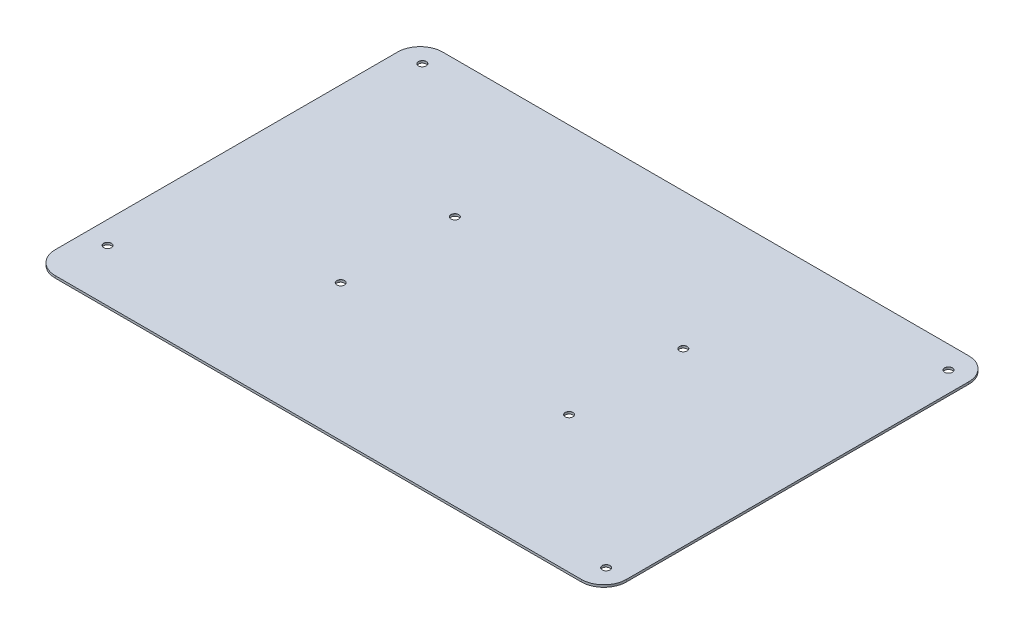
ISO-10303-21;
HEADER;
FILE_DESCRIPTION(('STEP AP214'),'2;1');
FILE_NAME('part.step','',(''),(''),'','','');
FILE_SCHEMA(('AUTOMOTIVE_DESIGN { 1 0 10303 214 1 1 1 1 }'));
ENDSEC;
DATA;
#1=APPLICATION_CONTEXT('core data for automotive mechanical design processes');
#2=APPLICATION_PROTOCOL_DEFINITION('international standard','automotive_design',2000,#1);
#3=PRODUCT_CONTEXT('',#1,'mechanical');
#4=PRODUCT('Part','Part','',(#3));
#5=PRODUCT_RELATED_PRODUCT_CATEGORY('part','',(#4));
#6=PRODUCT_DEFINITION_FORMATION('','',#4);
#7=PRODUCT_DEFINITION_CONTEXT('part definition',#1,'design');
#8=PRODUCT_DEFINITION('design','',#6,#7);
#9=PRODUCT_DEFINITION_SHAPE('','',#8);
#10=(LENGTH_UNIT() NAMED_UNIT(*) SI_UNIT(.MILLI.,.METRE.));
#11=(NAMED_UNIT(*) PLANE_ANGLE_UNIT() SI_UNIT($,.RADIAN.));
#12=(NAMED_UNIT(*) SI_UNIT($,.STERADIAN.) SOLID_ANGLE_UNIT());
#13=UNCERTAINTY_MEASURE_WITH_UNIT(LENGTH_MEASURE(1.E-05),#10,'distance_accuracy_value','');
#14=(GEOMETRIC_REPRESENTATION_CONTEXT(3) GLOBAL_UNCERTAINTY_ASSIGNED_CONTEXT((#13)) GLOBAL_UNIT_ASSIGNED_CONTEXT((#10,
#11,#12)) REPRESENTATION_CONTEXT('',''));
#15=CARTESIAN_POINT('',(0.,0.,0.));
#16=DIRECTION('',(0.,0.,1.));
#17=DIRECTION('',(1.,0.,0.));
#18=AXIS2_PLACEMENT_3D('',#15,#16,#17);
#19=CARTESIAN_POINT('',(127.,1.,-86.135));
#20=DIRECTION('',(-1.,0.,0.));
#21=DIRECTION('',(0.,0.,1.));
#22=AXIS2_PLACEMENT_3D('',#19,#20,#21);
#23=PLANE('',#22);
#24=DIRECTION('',(0.,0.,-1.));
#25=VECTOR('',#24,1.);
#26=CARTESIAN_POINT('',(127.,1.,-86.135));
#27=LINE('',#26,#25);
#28=CARTESIAN_POINT('',(127.,1.,76.135));
#29=VERTEX_POINT('',#28);
#30=CARTESIAN_POINT('',(127.,1.,-76.135));
#31=VERTEX_POINT('',#30);
#32=EDGE_CURVE('E140',#29,#31,#27,.T.);
#33=ORIENTED_EDGE('',*,*,#32,.F.);
#34=DIRECTION('',(0.,-1.,0.));
#35=VECTOR('',#34,1.);
#36=CARTESIAN_POINT('',(127.,1.,76.135));
#37=LINE('',#36,#35);
#38=CARTESIAN_POINT('',(127.,0.,76.135));
#39=VERTEX_POINT('',#38);
#40=EDGE_CURVE('E179',#29,#39,#37,.T.);
#41=ORIENTED_EDGE('',*,*,#40,.T.);
#42=DIRECTION('',(0.,0.,-1.));
#43=VECTOR('',#42,1.);
#44=CARTESIAN_POINT('',(127.,0.,-86.135));
#45=LINE('',#44,#43);
#46=CARTESIAN_POINT('',(127.,0.,-76.135));
#47=VERTEX_POINT('',#46);
#48=EDGE_CURVE('E194',#39,#47,#45,.T.);
#49=ORIENTED_EDGE('',*,*,#48,.T.);
#50=DIRECTION('',(0.,-1.,0.));
#51=VECTOR('',#50,1.);
#52=CARTESIAN_POINT('',(127.,1.,-76.135));
#53=LINE('',#52,#51);
#54=EDGE_CURVE('E176',#47,#31,#53,.F.);
#55=ORIENTED_EDGE('',*,*,#54,.T.);
#56=EDGE_LOOP('',(#33,#41,#49,#55));
#57=FACE_BOUND('',#56,.T.);
#58=ADVANCED_FACE('F44',(#57),#23,.F.);
#59=CARTESIAN_POINT('',(-127.,1.,-86.135));
#60=DIRECTION('',(0.,0.,1.));
#61=DIRECTION('',(1.,0.,0.));
#62=AXIS2_PLACEMENT_3D('',#59,#60,#61);
#63=PLANE('',#62);
#64=DIRECTION('',(-1.,0.,0.));
#65=VECTOR('',#64,1.);
#66=CARTESIAN_POINT('',(-127.,1.,-86.135));
#67=LINE('',#66,#65);
#68=CARTESIAN_POINT('',(117.,1.,-86.135));
#69=VERTEX_POINT('',#68);
#70=CARTESIAN_POINT('',(-117.,1.,-86.135));
#71=VERTEX_POINT('',#70);
#72=EDGE_CURVE('E145',#69,#71,#67,.T.);
#73=ORIENTED_EDGE('',*,*,#72,.F.);
#74=DIRECTION('',(0.,-1.,0.));
#75=VECTOR('',#74,1.);
#76=CARTESIAN_POINT('',(117.,1.,-86.135));
#77=LINE('',#76,#75);
#78=CARTESIAN_POINT('',(117.,0.,-86.135));
#79=VERTEX_POINT('',#78);
#80=EDGE_CURVE('E11',#69,#79,#77,.T.);
#81=ORIENTED_EDGE('',*,*,#80,.T.);
#82=DIRECTION('',(-1.,0.,0.));
#83=VECTOR('',#82,1.);
#84=CARTESIAN_POINT('',(-127.,0.,-86.135));
#85=LINE('',#84,#83);
#86=CARTESIAN_POINT('',(-117.,0.,-86.135));
#87=VERTEX_POINT('',#86);
#88=EDGE_CURVE('E147',#79,#87,#85,.T.);
#89=ORIENTED_EDGE('',*,*,#88,.T.);
#90=DIRECTION('',(0.,-1.,0.));
#91=VECTOR('',#90,1.);
#92=CARTESIAN_POINT('',(-117.,1.,-86.135));
#93=LINE('',#92,#91);
#94=EDGE_CURVE('E53',#87,#71,#93,.F.);
#95=ORIENTED_EDGE('',*,*,#94,.T.);
#96=EDGE_LOOP('',(#73,#81,#89,#95));
#97=FACE_BOUND('',#96,.T.);
#98=ADVANCED_FACE('F200',(#97),#63,.F.);
#99=CARTESIAN_POINT('',(-127.,1.,-86.135));
#100=DIRECTION('',(1.,0.,0.));
#101=DIRECTION('',(0.,0.,-1.));
#102=AXIS2_PLACEMENT_3D('',#99,#100,#101);
#103=PLANE('',#102);
#104=DIRECTION('',(0.,0.,1.));
#105=VECTOR('',#104,1.);
#106=CARTESIAN_POINT('',(-127.,0.,-86.135));
#107=LINE('',#106,#105);
#108=CARTESIAN_POINT('',(-127.,0.,-76.135));
#109=VERTEX_POINT('',#108);
#110=CARTESIAN_POINT('',(-127.,0.,76.135));
#111=VERTEX_POINT('',#110);
#112=EDGE_CURVE('E141',#109,#111,#107,.T.);
#113=ORIENTED_EDGE('',*,*,#112,.T.);
#114=DIRECTION('',(0.,-1.,0.));
#115=VECTOR('',#114,1.);
#116=CARTESIAN_POINT('',(-127.,1.,76.135));
#117=LINE('',#116,#115);
#118=CARTESIAN_POINT('',(-127.,1.,76.135));
#119=VERTEX_POINT('',#118);
#120=EDGE_CURVE('E116',#111,#119,#117,.F.);
#121=ORIENTED_EDGE('',*,*,#120,.T.);
#122=DIRECTION('',(0.,0.,1.));
#123=VECTOR('',#122,1.);
#124=CARTESIAN_POINT('',(-127.,1.,-86.135));
#125=LINE('',#124,#123);
#126=CARTESIAN_POINT('',(-127.,1.,-76.135));
#127=VERTEX_POINT('',#126);
#128=EDGE_CURVE('E185',#127,#119,#125,.T.);
#129=ORIENTED_EDGE('',*,*,#128,.F.);
#130=DIRECTION('',(0.,-1.,0.));
#131=VECTOR('',#130,1.);
#132=CARTESIAN_POINT('',(-127.,1.,-76.135));
#133=LINE('',#132,#131);
#134=EDGE_CURVE('E122',#127,#109,#133,.T.);
#135=ORIENTED_EDGE('',*,*,#134,.T.);
#136=EDGE_LOOP('',(#113,#121,#129,#135));
#137=FACE_BOUND('',#136,.T.);
#138=ADVANCED_FACE('F207',(#137),#103,.F.);
#139=CARTESIAN_POINT('',(-127.,1.,86.135));
#140=DIRECTION('',(0.,0.,-1.));
#141=DIRECTION('',(-1.,0.,0.));
#142=AXIS2_PLACEMENT_3D('',#139,#140,#141);
#143=PLANE('',#142);
#144=DIRECTION('',(1.,0.,0.));
#145=VECTOR('',#144,1.);
#146=CARTESIAN_POINT('',(-127.,1.,86.135));
#147=LINE('',#146,#145);
#148=CARTESIAN_POINT('',(-117.,1.,86.135));
#149=VERTEX_POINT('',#148);
#150=CARTESIAN_POINT('',(117.,1.,86.135));
#151=VERTEX_POINT('',#150);
#152=EDGE_CURVE('E132',#149,#151,#147,.T.);
#153=ORIENTED_EDGE('',*,*,#152,.F.);
#154=DIRECTION('',(0.,-1.,0.));
#155=VECTOR('',#154,1.);
#156=CARTESIAN_POINT('',(-117.,1.,86.135));
#157=LINE('',#156,#155);
#158=CARTESIAN_POINT('',(-117.,0.,86.135));
#159=VERTEX_POINT('',#158);
#160=EDGE_CURVE('E115',#149,#159,#157,.T.);
#161=ORIENTED_EDGE('',*,*,#160,.T.);
#162=DIRECTION('',(1.,0.,0.));
#163=VECTOR('',#162,1.);
#164=CARTESIAN_POINT('',(-127.,0.,86.135));
#165=LINE('',#164,#163);
#166=CARTESIAN_POINT('',(117.,0.,86.135));
#167=VERTEX_POINT('',#166);
#168=EDGE_CURVE('E129',#159,#167,#165,.T.);
#169=ORIENTED_EDGE('',*,*,#168,.T.);
#170=DIRECTION('',(0.,-1.,0.));
#171=VECTOR('',#170,1.);
#172=CARTESIAN_POINT('',(117.,1.,86.135));
#173=LINE('',#172,#171);
#174=EDGE_CURVE('E135',#167,#151,#173,.F.);
#175=ORIENTED_EDGE('',*,*,#174,.T.);
#176=EDGE_LOOP('',(#153,#161,#169,#175));
#177=FACE_BOUND('',#176,.T.);
#178=ADVANCED_FACE('F128',(#177),#143,.F.);
#179=CARTESIAN_POINT('',(0.,1.,0.));
#180=DIRECTION('',(0.,1.,0.));
#181=DIRECTION('',(0.,0.,1.));
#182=AXIS2_PLACEMENT_3D('',#179,#180,#181);
#183=PLANE('',#182);
#184=CARTESIAN_POINT('',(-117.,1.,-77.135));
#185=DIRECTION('',(0.,1.,0.));
#186=DIRECTION('',(0.,0.,1.));
#187=AXIS2_PLACEMENT_3D('',#184,#185,#186);
#188=CIRCLE('',#187,1.725);
#189=CARTESIAN_POINT('',(-117.,1.,-75.41));
#190=VERTEX_POINT('',#189);
#191=EDGE_CURVE('E366',#190,#190,#188,.T.);
#192=ORIENTED_EDGE('',*,*,#191,.F.);
#193=EDGE_LOOP('',(#192));
#194=FACE_BOUND('',#193,.T.);
#195=CARTESIAN_POINT('',(-117.,1.,62.865));
#196=DIRECTION('',(0.,1.,0.));
#197=DIRECTION('',(0.,0.,1.));
#198=AXIS2_PLACEMENT_3D('',#195,#196,#197);
#199=CIRCLE('',#198,1.725);
#200=CARTESIAN_POINT('',(-117.,1.,64.59));
#201=VERTEX_POINT('',#200);
#202=EDGE_CURVE('E356',#201,#201,#199,.T.);
#203=ORIENTED_EDGE('',*,*,#202,.F.);
#204=EDGE_LOOP('',(#203));
#205=FACE_BOUND('',#204,.T.);
#206=CARTESIAN_POINT('',(118.,1.,76.135));
#207=DIRECTION('',(0.,1.,0.));
#208=DIRECTION('',(0.,0.,1.));
#209=AXIS2_PLACEMENT_3D('',#206,#207,#208);
#210=CIRCLE('',#209,1.725);
#211=CARTESIAN_POINT('',(118.,1.,77.86));
#212=VERTEX_POINT('',#211);
#213=EDGE_CURVE('E346',#212,#212,#210,.T.);
#214=ORIENTED_EDGE('',*,*,#213,.F.);
#215=EDGE_LOOP('',(#214));
#216=FACE_BOUND('',#215,.T.);
#217=CARTESIAN_POINT('',(118.,1.,-76.135));
#218=DIRECTION('',(0.,1.,0.));
#219=DIRECTION('',(0.,0.,1.));
#220=AXIS2_PLACEMENT_3D('',#217,#218,#219);
#221=CIRCLE('',#220,1.725);
#222=CARTESIAN_POINT('',(118.,1.,-74.41));
#223=VERTEX_POINT('',#222);
#224=EDGE_CURVE('E336',#223,#223,#221,.T.);
#225=ORIENTED_EDGE('',*,*,#224,.F.);
#226=EDGE_LOOP('',(#225));
#227=FACE_BOUND('',#226,.T.);
#228=CARTESIAN_POINT('',(-50.8,1.,25.4));
#229=DIRECTION('',(0.,1.,0.));
#230=DIRECTION('',(0.,0.,1.));
#231=AXIS2_PLACEMENT_3D('',#228,#229,#230);
#232=CIRCLE('',#231,1.725);
#233=CARTESIAN_POINT('',(-50.8,1.,27.125));
#234=VERTEX_POINT('',#233);
#235=EDGE_CURVE('E326',#234,#234,#232,.T.);
#236=ORIENTED_EDGE('',*,*,#235,.F.);
#237=EDGE_LOOP('',(#236));
#238=FACE_BOUND('',#237,.T.);
#239=CARTESIAN_POINT('',(50.8,1.,25.4));
#240=DIRECTION('',(0.,1.,0.));
#241=DIRECTION('',(0.,0.,1.));
#242=AXIS2_PLACEMENT_3D('',#239,#240,#241);
#243=CIRCLE('',#242,1.725);
#244=CARTESIAN_POINT('',(50.8,1.,27.125));
#245=VERTEX_POINT('',#244);
#246=EDGE_CURVE('E316',#245,#245,#243,.T.);
#247=ORIENTED_EDGE('',*,*,#246,.F.);
#248=EDGE_LOOP('',(#247));
#249=FACE_BOUND('',#248,.T.);
#250=CARTESIAN_POINT('',(-50.8,1.,-25.4));
#251=DIRECTION('',(0.,1.,0.));
#252=DIRECTION('',(0.,0.,1.));
#253=AXIS2_PLACEMENT_3D('',#250,#251,#252);
#254=CIRCLE('',#253,1.725);
#255=CARTESIAN_POINT('',(-50.8,1.,-23.675));
#256=VERTEX_POINT('',#255);
#257=EDGE_CURVE('E306',#256,#256,#254,.T.);
#258=ORIENTED_EDGE('',*,*,#257,.F.);
#259=EDGE_LOOP('',(#258));
#260=FACE_BOUND('',#259,.T.);
#261=CARTESIAN_POINT('',(50.8,1.,-25.4));
#262=DIRECTION('',(0.,1.,0.));
#263=DIRECTION('',(0.,0.,1.));
#264=AXIS2_PLACEMENT_3D('',#261,#262,#263);
#265=CIRCLE('',#264,1.725);
#266=CARTESIAN_POINT('',(50.8,1.,-23.675));
#267=VERTEX_POINT('',#266);
#268=EDGE_CURVE('E294',#267,#267,#265,.T.);
#269=ORIENTED_EDGE('',*,*,#268,.F.);
#270=EDGE_LOOP('',(#269));
#271=FACE_BOUND('',#270,.T.);
#272=ORIENTED_EDGE('',*,*,#128,.T.);
#273=CARTESIAN_POINT('',(-117.,1.,76.135));
#274=DIRECTION('',(0.,1.,0.));
#275=DIRECTION('',(0.,0.,1.));
#276=AXIS2_PLACEMENT_3D('',#273,#274,#275);
#277=CIRCLE('',#276,10.);
#278=EDGE_CURVE('E173',#119,#149,#277,.T.);
#279=ORIENTED_EDGE('',*,*,#278,.T.);
#280=ORIENTED_EDGE('',*,*,#152,.T.);
#281=CARTESIAN_POINT('',(117.,1.,76.135));
#282=DIRECTION('',(0.,1.,0.));
#283=DIRECTION('',(0.,0.,1.));
#284=AXIS2_PLACEMENT_3D('',#281,#282,#283);
#285=CIRCLE('',#284,10.);
#286=EDGE_CURVE('E170',#151,#29,#285,.T.);
#287=ORIENTED_EDGE('',*,*,#286,.T.);
#288=ORIENTED_EDGE('',*,*,#32,.T.);
#289=CARTESIAN_POINT('',(117.,1.,-76.135));
#290=DIRECTION('',(0.,1.,0.));
#291=DIRECTION('',(0.,0.,1.));
#292=AXIS2_PLACEMENT_3D('',#289,#290,#291);
#293=CIRCLE('',#292,10.);
#294=EDGE_CURVE('E66',#31,#69,#293,.T.);
#295=ORIENTED_EDGE('',*,*,#294,.T.);
#296=ORIENTED_EDGE('',*,*,#72,.T.);
#297=CARTESIAN_POINT('',(-117.,1.,-76.135));
#298=DIRECTION('',(0.,1.,0.));
#299=DIRECTION('',(0.,0.,1.));
#300=AXIS2_PLACEMENT_3D('',#297,#298,#299);
#301=CIRCLE('',#300,10.);
#302=EDGE_CURVE('E165',#71,#127,#301,.T.);
#303=ORIENTED_EDGE('',*,*,#302,.T.);
#304=EDGE_LOOP('',(#272,#279,#280,#287,#288,#295,#296,#303));
#305=FACE_BOUND('',#304,.T.);
#306=ADVANCED_FACE('F205',(#194,#205,#216,#227,#238,#249,#260,#271,#305),#183,.T.);
#307=CARTESIAN_POINT('',(0.,0.,0.));
#308=DIRECTION('',(0.,1.,0.));
#309=DIRECTION('',(0.,0.,1.));
#310=AXIS2_PLACEMENT_3D('',#307,#308,#309);
#311=PLANE('',#310);
#312=CARTESIAN_POINT('',(-117.,0.,-77.135));
#313=DIRECTION('',(0.,1.,0.));
#314=DIRECTION('',(0.,0.,1.));
#315=AXIS2_PLACEMENT_3D('',#312,#313,#314);
#316=CIRCLE('',#315,1.69999999999999);
#317=CARTESIAN_POINT('',(-117.,0.,-75.435));
#318=VERTEX_POINT('',#317);
#319=EDGE_CURVE('E264',#318,#318,#316,.T.);
#320=ORIENTED_EDGE('',*,*,#319,.T.);
#321=EDGE_LOOP('',(#320));
#322=FACE_BOUND('',#321,.T.);
#323=CARTESIAN_POINT('',(-117.,0.,62.865));
#324=DIRECTION('',(0.,1.,0.));
#325=DIRECTION('',(0.,0.,1.));
#326=AXIS2_PLACEMENT_3D('',#323,#324,#325);
#327=CIRCLE('',#326,1.69999999999999);
#328=CARTESIAN_POINT('',(-117.,0.,64.565));
#329=VERTEX_POINT('',#328);
#330=EDGE_CURVE('E268',#329,#329,#327,.T.);
#331=ORIENTED_EDGE('',*,*,#330,.T.);
#332=EDGE_LOOP('',(#331));
#333=FACE_BOUND('',#332,.T.);
#334=CARTESIAN_POINT('',(118.,0.,76.135));
#335=DIRECTION('',(0.,1.,0.));
#336=DIRECTION('',(0.,0.,1.));
#337=AXIS2_PLACEMENT_3D('',#334,#335,#336);
#338=CIRCLE('',#337,1.69999999999999);
#339=CARTESIAN_POINT('',(118.,0.,77.835));
#340=VERTEX_POINT('',#339);
#341=EDGE_CURVE('E272',#340,#340,#338,.T.);
#342=ORIENTED_EDGE('',*,*,#341,.T.);
#343=EDGE_LOOP('',(#342));
#344=FACE_BOUND('',#343,.T.);
#345=CARTESIAN_POINT('',(118.,0.,-76.135));
#346=DIRECTION('',(0.,1.,0.));
#347=DIRECTION('',(0.,0.,1.));
#348=AXIS2_PLACEMENT_3D('',#345,#346,#347);
#349=CIRCLE('',#348,1.69999999999999);
#350=CARTESIAN_POINT('',(118.,0.,-74.435));
#351=VERTEX_POINT('',#350);
#352=EDGE_CURVE('E276',#351,#351,#349,.T.);
#353=ORIENTED_EDGE('',*,*,#352,.T.);
#354=EDGE_LOOP('',(#353));
#355=FACE_BOUND('',#354,.T.);
#356=CARTESIAN_POINT('',(-50.8,0.,25.4));
#357=DIRECTION('',(0.,1.,0.));
#358=DIRECTION('',(0.,0.,1.));
#359=AXIS2_PLACEMENT_3D('',#356,#357,#358);
#360=CIRCLE('',#359,1.7);
#361=CARTESIAN_POINT('',(-50.8,0.,27.1));
#362=VERTEX_POINT('',#361);
#363=EDGE_CURVE('E280',#362,#362,#360,.T.);
#364=ORIENTED_EDGE('',*,*,#363,.T.);
#365=EDGE_LOOP('',(#364));
#366=FACE_BOUND('',#365,.T.);
#367=CARTESIAN_POINT('',(50.8,0.,25.4));
#368=DIRECTION('',(0.,1.,0.));
#369=DIRECTION('',(0.,0.,1.));
#370=AXIS2_PLACEMENT_3D('',#367,#368,#369);
#371=CIRCLE('',#370,1.7);
#372=CARTESIAN_POINT('',(50.8,0.,27.1));
#373=VERTEX_POINT('',#372);
#374=EDGE_CURVE('E284',#373,#373,#371,.T.);
#375=ORIENTED_EDGE('',*,*,#374,.T.);
#376=EDGE_LOOP('',(#375));
#377=FACE_BOUND('',#376,.T.);
#378=CARTESIAN_POINT('',(-50.8,0.,-25.4));
#379=DIRECTION('',(0.,1.,0.));
#380=DIRECTION('',(0.,0.,1.));
#381=AXIS2_PLACEMENT_3D('',#378,#379,#380);
#382=CIRCLE('',#381,1.7);
#383=CARTESIAN_POINT('',(-50.8,0.,-23.7));
#384=VERTEX_POINT('',#383);
#385=EDGE_CURVE('E288',#384,#384,#382,.T.);
#386=ORIENTED_EDGE('',*,*,#385,.T.);
#387=EDGE_LOOP('',(#386));
#388=FACE_BOUND('',#387,.T.);
#389=CARTESIAN_POINT('',(50.8,0.,-25.4));
#390=DIRECTION('',(0.,1.,0.));
#391=DIRECTION('',(0.,0.,1.));
#392=AXIS2_PLACEMENT_3D('',#389,#390,#391);
#393=CIRCLE('',#392,1.7);
#394=CARTESIAN_POINT('',(50.8,0.,-23.7));
#395=VERTEX_POINT('',#394);
#396=EDGE_CURVE('E197',#395,#395,#393,.T.);
#397=ORIENTED_EDGE('',*,*,#396,.T.);
#398=EDGE_LOOP('',(#397));
#399=FACE_BOUND('',#398,.T.);
#400=ORIENTED_EDGE('',*,*,#168,.F.);
#401=CARTESIAN_POINT('',(-117.,0.,76.135));
#402=DIRECTION('',(0.,1.,0.));
#403=DIRECTION('',(0.,0.,1.));
#404=AXIS2_PLACEMENT_3D('',#401,#402,#403);
#405=CIRCLE('',#404,10.);
#406=EDGE_CURVE('E111',#159,#111,#405,.F.);
#407=ORIENTED_EDGE('',*,*,#406,.T.);
#408=ORIENTED_EDGE('',*,*,#112,.F.);
#409=CARTESIAN_POINT('',(-117.,0.,-76.135));
#410=DIRECTION('',(0.,1.,0.));
#411=DIRECTION('',(0.,0.,1.));
#412=AXIS2_PLACEMENT_3D('',#409,#410,#411);
#413=CIRCLE('',#412,10.);
#414=EDGE_CURVE('E134',#109,#87,#413,.F.);
#415=ORIENTED_EDGE('',*,*,#414,.T.);
#416=ORIENTED_EDGE('',*,*,#88,.F.);
#417=CARTESIAN_POINT('',(117.,0.,-76.135));
#418=DIRECTION('',(0.,1.,0.));
#419=DIRECTION('',(0.,0.,1.));
#420=AXIS2_PLACEMENT_3D('',#417,#418,#419);
#421=CIRCLE('',#420,10.);
#422=EDGE_CURVE('E155',#79,#47,#421,.F.);
#423=ORIENTED_EDGE('',*,*,#422,.T.);
#424=ORIENTED_EDGE('',*,*,#48,.F.);
#425=CARTESIAN_POINT('',(117.,0.,76.135));
#426=DIRECTION('',(0.,1.,0.));
#427=DIRECTION('',(0.,0.,1.));
#428=AXIS2_PLACEMENT_3D('',#425,#426,#427);
#429=CIRCLE('',#428,10.);
#430=EDGE_CURVE('E123',#39,#167,#429,.F.);
#431=ORIENTED_EDGE('',*,*,#430,.T.);
#432=EDGE_LOOP('',(#400,#407,#408,#415,#416,#423,#424,#431));
#433=FACE_BOUND('',#432,.T.);
#434=ADVANCED_FACE('F137',(#322,#333,#344,#355,#366,#377,#388,#399,#433),#311,.F.);
#435=CARTESIAN_POINT('',(-117.,1.,76.135));
#436=DIRECTION('',(0.,-1.,0.));
#437=DIRECTION('',(0.,0.,-1.));
#438=AXIS2_PLACEMENT_3D('',#435,#436,#437);
#439=CYLINDRICAL_SURFACE('',#438,10.);
#440=ORIENTED_EDGE('',*,*,#278,.F.);
#441=ORIENTED_EDGE('',*,*,#120,.F.);
#442=ORIENTED_EDGE('',*,*,#406,.F.);
#443=ORIENTED_EDGE('',*,*,#160,.F.);
#444=EDGE_LOOP('',(#440,#441,#442,#443));
#445=FACE_BOUND('',#444,.T.);
#446=ADVANCED_FACE('F114',(#445),#439,.T.);
#447=CARTESIAN_POINT('',(117.,1.,76.135));
#448=DIRECTION('',(0.,-1.,0.));
#449=DIRECTION('',(0.,0.,-1.));
#450=AXIS2_PLACEMENT_3D('',#447,#448,#449);
#451=CYLINDRICAL_SURFACE('',#450,10.);
#452=ORIENTED_EDGE('',*,*,#286,.F.);
#453=ORIENTED_EDGE('',*,*,#174,.F.);
#454=ORIENTED_EDGE('',*,*,#430,.F.);
#455=ORIENTED_EDGE('',*,*,#40,.F.);
#456=EDGE_LOOP('',(#452,#453,#454,#455));
#457=FACE_BOUND('',#456,.T.);
#458=ADVANCED_FACE('F225',(#457),#451,.T.);
#459=CARTESIAN_POINT('',(117.,1.,-76.135));
#460=DIRECTION('',(0.,-1.,0.));
#461=DIRECTION('',(0.,0.,-1.));
#462=AXIS2_PLACEMENT_3D('',#459,#460,#461);
#463=CYLINDRICAL_SURFACE('',#462,10.);
#464=ORIENTED_EDGE('',*,*,#294,.F.);
#465=ORIENTED_EDGE('',*,*,#54,.F.);
#466=ORIENTED_EDGE('',*,*,#422,.F.);
#467=ORIENTED_EDGE('',*,*,#80,.F.);
#468=EDGE_LOOP('',(#464,#465,#466,#467));
#469=FACE_BOUND('',#468,.T.);
#470=ADVANCED_FACE('F227',(#469),#463,.T.);
#471=CARTESIAN_POINT('',(-117.,1.,-76.135));
#472=DIRECTION('',(0.,-1.,0.));
#473=DIRECTION('',(0.,0.,-1.));
#474=AXIS2_PLACEMENT_3D('',#471,#472,#473);
#475=CYLINDRICAL_SURFACE('',#474,10.);
#476=ORIENTED_EDGE('',*,*,#302,.F.);
#477=ORIENTED_EDGE('',*,*,#94,.F.);
#478=ORIENTED_EDGE('',*,*,#414,.F.);
#479=ORIENTED_EDGE('',*,*,#134,.F.);
#480=EDGE_LOOP('',(#476,#477,#478,#479));
#481=FACE_BOUND('',#480,.T.);
#482=ADVANCED_FACE('F46',(#481),#475,.T.);
#483=CARTESIAN_POINT('',(50.8,1.,-25.4));
#484=DIRECTION('',(0.,1.,0.));
#485=DIRECTION('',(0.,0.,1.));
#486=AXIS2_PLACEMENT_3D('',#483,#484,#485);
#487=CYLINDRICAL_SURFACE('',#486,1.7);
#488=ORIENTED_EDGE('',*,*,#396,.F.);
#489=EDGE_LOOP('',(#488));
#490=FACE_BOUND('',#489,.T.);
#491=CARTESIAN_POINT('',(50.8,0.974999999999998,-25.4));
#492=DIRECTION('',(0.,1.,0.));
#493=DIRECTION('',(0.,0.,1.));
#494=AXIS2_PLACEMENT_3D('',#491,#492,#493);
#495=CIRCLE('',#494,1.7);
#496=CARTESIAN_POINT('',(50.8,0.974999999999998,-23.7));
#497=VERTEX_POINT('',#496);
#498=EDGE_CURVE('E291',#497,#497,#495,.T.);
#499=ORIENTED_EDGE('',*,*,#498,.T.);
#500=EDGE_LOOP('',(#499));
#501=FACE_BOUND('',#500,.T.);
#502=ADVANCED_FACE('F234',(#490,#501),#487,.F.);
#503=CARTESIAN_POINT('',(50.8,1.,-25.4));
#504=DIRECTION('',(0.,1.,0.));
#505=DIRECTION('',(0.,0.,1.));
#506=AXIS2_PLACEMENT_3D('',#503,#504,#505);
#507=CONICAL_SURFACE('',#506,1.725,0.785398163397344);
#508=ORIENTED_EDGE('',*,*,#498,.F.);
#509=EDGE_LOOP('',(#508));
#510=FACE_BOUND('',#509,.T.);
#511=ORIENTED_EDGE('',*,*,#268,.T.);
#512=EDGE_LOOP('',(#511));
#513=FACE_BOUND('',#512,.T.);
#514=ADVANCED_FACE('F242',(#510,#513),#507,.F.);
#515=CARTESIAN_POINT('',(-50.8,1.,-25.4));
#516=DIRECTION('',(0.,1.,0.));
#517=DIRECTION('',(0.,0.,1.));
#518=AXIS2_PLACEMENT_3D('',#515,#516,#517);
#519=CYLINDRICAL_SURFACE('',#518,1.7);
#520=ORIENTED_EDGE('',*,*,#385,.F.);
#521=EDGE_LOOP('',(#520));
#522=FACE_BOUND('',#521,.T.);
#523=CARTESIAN_POINT('',(-50.8,0.974999999999998,-25.4));
#524=DIRECTION('',(0.,1.,0.));
#525=DIRECTION('',(0.,0.,1.));
#526=AXIS2_PLACEMENT_3D('',#523,#524,#525);
#527=CIRCLE('',#526,1.7);
#528=CARTESIAN_POINT('',(-50.8,0.974999999999998,-23.7));
#529=VERTEX_POINT('',#528);
#530=EDGE_CURVE('E302',#529,#529,#527,.T.);
#531=ORIENTED_EDGE('',*,*,#530,.T.);
#532=EDGE_LOOP('',(#531));
#533=FACE_BOUND('',#532,.T.);
#534=ADVANCED_FACE('F249',(#522,#533),#519,.F.);
#535=CARTESIAN_POINT('',(-50.8,1.,-25.4));
#536=DIRECTION('',(0.,1.,0.));
#537=DIRECTION('',(0.,0.,1.));
#538=AXIS2_PLACEMENT_3D('',#535,#536,#537);
#539=CONICAL_SURFACE('',#538,1.725,0.785398163397344);
#540=ORIENTED_EDGE('',*,*,#530,.F.);
#541=EDGE_LOOP('',(#540));
#542=FACE_BOUND('',#541,.T.);
#543=ORIENTED_EDGE('',*,*,#257,.T.);
#544=EDGE_LOOP('',(#543));
#545=FACE_BOUND('',#544,.T.);
#546=ADVANCED_FACE('F388',(#542,#545),#539,.F.);
#547=CARTESIAN_POINT('',(50.8,1.,25.4));
#548=DIRECTION('',(0.,1.,0.));
#549=DIRECTION('',(0.,0.,1.));
#550=AXIS2_PLACEMENT_3D('',#547,#548,#549);
#551=CYLINDRICAL_SURFACE('',#550,1.7);
#552=ORIENTED_EDGE('',*,*,#374,.F.);
#553=EDGE_LOOP('',(#552));
#554=FACE_BOUND('',#553,.T.);
#555=CARTESIAN_POINT('',(50.8,0.974999999999998,25.4));
#556=DIRECTION('',(0.,1.,0.));
#557=DIRECTION('',(0.,0.,1.));
#558=AXIS2_PLACEMENT_3D('',#555,#556,#557);
#559=CIRCLE('',#558,1.7);
#560=CARTESIAN_POINT('',(50.8,0.974999999999998,27.1));
#561=VERTEX_POINT('',#560);
#562=EDGE_CURVE('E312',#561,#561,#559,.T.);
#563=ORIENTED_EDGE('',*,*,#562,.T.);
#564=EDGE_LOOP('',(#563));
#565=FACE_BOUND('',#564,.T.);
#566=ADVANCED_FACE('F390',(#554,#565),#551,.F.);
#567=CARTESIAN_POINT('',(50.8,1.,25.4));
#568=DIRECTION('',(0.,1.,0.));
#569=DIRECTION('',(0.,0.,1.));
#570=AXIS2_PLACEMENT_3D('',#567,#568,#569);
#571=CONICAL_SURFACE('',#570,1.725,0.785398163397344);
#572=ORIENTED_EDGE('',*,*,#562,.F.);
#573=EDGE_LOOP('',(#572));
#574=FACE_BOUND('',#573,.T.);
#575=ORIENTED_EDGE('',*,*,#246,.T.);
#576=EDGE_LOOP('',(#575));
#577=FACE_BOUND('',#576,.T.);
#578=ADVANCED_FACE('F397',(#574,#577),#571,.F.);
#579=CARTESIAN_POINT('',(-50.8,1.,25.4));
#580=DIRECTION('',(0.,1.,0.));
#581=DIRECTION('',(0.,0.,1.));
#582=AXIS2_PLACEMENT_3D('',#579,#580,#581);
#583=CYLINDRICAL_SURFACE('',#582,1.7);
#584=ORIENTED_EDGE('',*,*,#363,.F.);
#585=EDGE_LOOP('',(#584));
#586=FACE_BOUND('',#585,.T.);
#587=CARTESIAN_POINT('',(-50.8,0.974999999999998,25.4));
#588=DIRECTION('',(0.,1.,0.));
#589=DIRECTION('',(0.,0.,1.));
#590=AXIS2_PLACEMENT_3D('',#587,#588,#589);
#591=CIRCLE('',#590,1.7);
#592=CARTESIAN_POINT('',(-50.8,0.974999999999998,27.1));
#593=VERTEX_POINT('',#592);
#594=EDGE_CURVE('E322',#593,#593,#591,.T.);
#595=ORIENTED_EDGE('',*,*,#594,.T.);
#596=EDGE_LOOP('',(#595));
#597=FACE_BOUND('',#596,.T.);
#598=ADVANCED_FACE('F405',(#586,#597),#583,.F.);
#599=CARTESIAN_POINT('',(-50.8,1.,25.4));
#600=DIRECTION('',(0.,1.,0.));
#601=DIRECTION('',(0.,0.,1.));
#602=AXIS2_PLACEMENT_3D('',#599,#600,#601);
#603=CONICAL_SURFACE('',#602,1.725,0.785398163397344);
#604=ORIENTED_EDGE('',*,*,#594,.F.);
#605=EDGE_LOOP('',(#604));
#606=FACE_BOUND('',#605,.T.);
#607=ORIENTED_EDGE('',*,*,#235,.T.);
#608=EDGE_LOOP('',(#607));
#609=FACE_BOUND('',#608,.T.);
#610=ADVANCED_FACE('F409',(#606,#609),#603,.F.);
#611=CARTESIAN_POINT('',(118.,1.,-76.135));
#612=DIRECTION('',(0.,1.,0.));
#613=DIRECTION('',(0.,0.,1.));
#614=AXIS2_PLACEMENT_3D('',#611,#612,#613);
#615=CYLINDRICAL_SURFACE('',#614,1.69999999999999);
#616=ORIENTED_EDGE('',*,*,#352,.F.);
#617=EDGE_LOOP('',(#616));
#618=FACE_BOUND('',#617,.T.);
#619=CARTESIAN_POINT('',(118.,0.974999999999998,-76.135));
#620=DIRECTION('',(0.,1.,0.));
#621=DIRECTION('',(0.,0.,1.));
#622=AXIS2_PLACEMENT_3D('',#619,#620,#621);
#623=CIRCLE('',#622,1.69999999999999);
#624=CARTESIAN_POINT('',(118.,0.974999999999998,-74.435));
#625=VERTEX_POINT('',#624);
#626=EDGE_CURVE('E332',#625,#625,#623,.T.);
#627=ORIENTED_EDGE('',*,*,#626,.T.);
#628=EDGE_LOOP('',(#627));
#629=FACE_BOUND('',#628,.T.);
#630=ADVANCED_FACE('F413',(#618,#629),#615,.F.);
#631=CARTESIAN_POINT('',(118.,1.,-76.135));
#632=DIRECTION('',(0.,1.,0.));
#633=DIRECTION('',(0.,0.,1.));
#634=AXIS2_PLACEMENT_3D('',#631,#632,#633);
#635=CONICAL_SURFACE('',#634,1.725,0.785398163397622);
#636=ORIENTED_EDGE('',*,*,#626,.F.);
#637=EDGE_LOOP('',(#636));
#638=FACE_BOUND('',#637,.T.);
#639=ORIENTED_EDGE('',*,*,#224,.T.);
#640=EDGE_LOOP('',(#639));
#641=FACE_BOUND('',#640,.T.);
#642=ADVANCED_FACE('F417',(#638,#641),#635,.F.);
#643=CARTESIAN_POINT('',(118.,1.,76.135));
#644=DIRECTION('',(0.,1.,0.));
#645=DIRECTION('',(0.,0.,1.));
#646=AXIS2_PLACEMENT_3D('',#643,#644,#645);
#647=CYLINDRICAL_SURFACE('',#646,1.69999999999999);
#648=ORIENTED_EDGE('',*,*,#341,.F.);
#649=EDGE_LOOP('',(#648));
#650=FACE_BOUND('',#649,.T.);
#651=CARTESIAN_POINT('',(118.,0.974999999999998,76.135));
#652=DIRECTION('',(0.,1.,0.));
#653=DIRECTION('',(0.,0.,1.));
#654=AXIS2_PLACEMENT_3D('',#651,#652,#653);
#655=CIRCLE('',#654,1.69999999999999);
#656=CARTESIAN_POINT('',(118.,0.974999999999998,77.835));
#657=VERTEX_POINT('',#656);
#658=EDGE_CURVE('E342',#657,#657,#655,.T.);
#659=ORIENTED_EDGE('',*,*,#658,.T.);
#660=EDGE_LOOP('',(#659));
#661=FACE_BOUND('',#660,.T.);
#662=ADVANCED_FACE('F421',(#650,#661),#647,.F.);
#663=CARTESIAN_POINT('',(118.,1.,76.135));
#664=DIRECTION('',(0.,1.,0.));
#665=DIRECTION('',(0.,0.,1.));
#666=AXIS2_PLACEMENT_3D('',#663,#664,#665);
#667=CONICAL_SURFACE('',#666,1.725,0.785398163397622);
#668=ORIENTED_EDGE('',*,*,#658,.F.);
#669=EDGE_LOOP('',(#668));
#670=FACE_BOUND('',#669,.T.);
#671=ORIENTED_EDGE('',*,*,#213,.T.);
#672=EDGE_LOOP('',(#671));
#673=FACE_BOUND('',#672,.T.);
#674=ADVANCED_FACE('F425',(#670,#673),#667,.F.);
#675=CARTESIAN_POINT('',(-117.,1.,62.865));
#676=DIRECTION('',(0.,1.,0.));
#677=DIRECTION('',(0.,0.,1.));
#678=AXIS2_PLACEMENT_3D('',#675,#676,#677);
#679=CYLINDRICAL_SURFACE('',#678,1.69999999999999);
#680=ORIENTED_EDGE('',*,*,#330,.F.);
#681=EDGE_LOOP('',(#680));
#682=FACE_BOUND('',#681,.T.);
#683=CARTESIAN_POINT('',(-117.,0.974999999999998,62.865));
#684=DIRECTION('',(0.,1.,0.));
#685=DIRECTION('',(0.,0.,1.));
#686=AXIS2_PLACEMENT_3D('',#683,#684,#685);
#687=CIRCLE('',#686,1.69999999999999);
#688=CARTESIAN_POINT('',(-117.,0.974999999999998,64.565));
#689=VERTEX_POINT('',#688);
#690=EDGE_CURVE('E352',#689,#689,#687,.T.);
#691=ORIENTED_EDGE('',*,*,#690,.T.);
#692=EDGE_LOOP('',(#691));
#693=FACE_BOUND('',#692,.T.);
#694=ADVANCED_FACE('F429',(#682,#693),#679,.F.);
#695=CARTESIAN_POINT('',(-117.,1.,62.865));
#696=DIRECTION('',(0.,1.,0.));
#697=DIRECTION('',(0.,0.,1.));
#698=AXIS2_PLACEMENT_3D('',#695,#696,#697);
#699=CONICAL_SURFACE('',#698,1.725,0.785398163397622);
#700=ORIENTED_EDGE('',*,*,#690,.F.);
#701=EDGE_LOOP('',(#700));
#702=FACE_BOUND('',#701,.T.);
#703=ORIENTED_EDGE('',*,*,#202,.T.);
#704=EDGE_LOOP('',(#703));
#705=FACE_BOUND('',#704,.T.);
#706=ADVANCED_FACE('F433',(#702,#705),#699,.F.);
#707=CARTESIAN_POINT('',(-117.,1.,-77.135));
#708=DIRECTION('',(0.,1.,0.));
#709=DIRECTION('',(0.,0.,1.));
#710=AXIS2_PLACEMENT_3D('',#707,#708,#709);
#711=CYLINDRICAL_SURFACE('',#710,1.69999999999999);
#712=ORIENTED_EDGE('',*,*,#319,.F.);
#713=EDGE_LOOP('',(#712));
#714=FACE_BOUND('',#713,.T.);
#715=CARTESIAN_POINT('',(-117.,0.974999999999998,-77.135));
#716=DIRECTION('',(0.,1.,0.));
#717=DIRECTION('',(0.,0.,1.));
#718=AXIS2_PLACEMENT_3D('',#715,#716,#717);
#719=CIRCLE('',#718,1.69999999999999);
#720=CARTESIAN_POINT('',(-117.,0.974999999999998,-75.435));
#721=VERTEX_POINT('',#720);
#722=EDGE_CURVE('E362',#721,#721,#719,.T.);
#723=ORIENTED_EDGE('',*,*,#722,.T.);
#724=EDGE_LOOP('',(#723));
#725=FACE_BOUND('',#724,.T.);
#726=ADVANCED_FACE('F437',(#714,#725),#711,.F.);
#727=CARTESIAN_POINT('',(-117.,1.,-77.135));
#728=DIRECTION('',(0.,1.,0.));
#729=DIRECTION('',(0.,0.,1.));
#730=AXIS2_PLACEMENT_3D('',#727,#728,#729);
#731=CONICAL_SURFACE('',#730,1.725,0.785398163397622);
#732=ORIENTED_EDGE('',*,*,#722,.F.);
#733=EDGE_LOOP('',(#732));
#734=FACE_BOUND('',#733,.T.);
#735=ORIENTED_EDGE('',*,*,#191,.T.);
#736=EDGE_LOOP('',(#735));
#737=FACE_BOUND('',#736,.T.);
#738=ADVANCED_FACE('F371',(#734,#737),#731,.F.);
#739=CLOSED_SHELL('',(#58,#98,#138,#178,#306,#434,#446,#458,#470,#482,#502,#514,#534,#546,#566,
#578,#598,#610,#630,#642,#662,#674,#694,#706,#726,#738));
#740=MANIFOLD_SOLID_BREP('B2',#739);
#741=ADVANCED_BREP_SHAPE_REPRESENTATION('',(#18,#740),#14);
#742=SHAPE_DEFINITION_REPRESENTATION(#9,#741);
ENDSEC;
END-ISO-10303-21;
